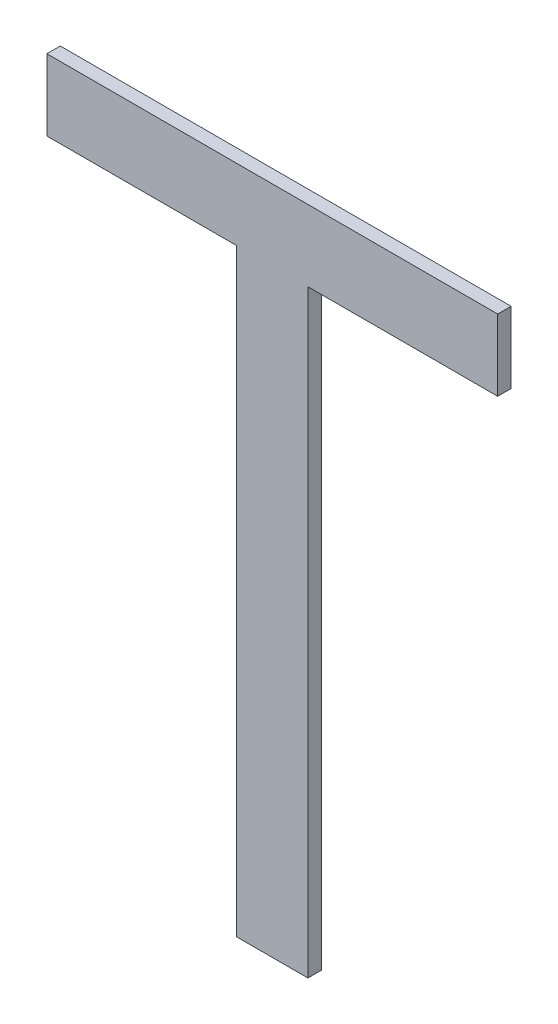
ISO-10303-21;
HEADER;
FILE_DESCRIPTION(('STEP AP214'),'2;1');
FILE_NAME('part.step','',(''),(''),'','','');
FILE_SCHEMA(('AUTOMOTIVE_DESIGN { 1 0 10303 214 1 1 1 1 }'));
ENDSEC;
DATA;
#1=APPLICATION_CONTEXT('core data for automotive mechanical design processes');
#2=APPLICATION_PROTOCOL_DEFINITION('international standard','automotive_design',2000,#1);
#3=PRODUCT_CONTEXT('',#1,'mechanical');
#4=PRODUCT('Part','Part','',(#3));
#5=PRODUCT_RELATED_PRODUCT_CATEGORY('part','',(#4));
#6=PRODUCT_DEFINITION_FORMATION('','',#4);
#7=PRODUCT_DEFINITION_CONTEXT('part definition',#1,'design');
#8=PRODUCT_DEFINITION('design','',#6,#7);
#9=PRODUCT_DEFINITION_SHAPE('','',#8);
#10=(LENGTH_UNIT() NAMED_UNIT(*) SI_UNIT(.MILLI.,.METRE.));
#11=(NAMED_UNIT(*) PLANE_ANGLE_UNIT() SI_UNIT($,.RADIAN.));
#12=(NAMED_UNIT(*) SI_UNIT($,.STERADIAN.) SOLID_ANGLE_UNIT());
#13=UNCERTAINTY_MEASURE_WITH_UNIT(LENGTH_MEASURE(1.E-05),#10,'distance_accuracy_value','');
#14=(GEOMETRIC_REPRESENTATION_CONTEXT(3) GLOBAL_UNCERTAINTY_ASSIGNED_CONTEXT((#13)) GLOBAL_UNIT_ASSIGNED_CONTEXT((#10,
#11,#12)) REPRESENTATION_CONTEXT('',''));
#15=CARTESIAN_POINT('',(0.,0.,0.));
#16=DIRECTION('',(0.,0.,1.));
#17=DIRECTION('',(1.,0.,0.));
#18=AXIS2_PLACEMENT_3D('',#15,#16,#17);
#19=CARTESIAN_POINT('',(161.371205904713,146.668671803981,5.9));
#20=DIRECTION('',(0.,0.,1.));
#21=DIRECTION('',(1.,0.,0.));
#22=AXIS2_PLACEMENT_3D('',#19,#20,#21);
#23=PLANE('',#22);
#24=DIRECTION('',(1.,0.,0.));
#25=VECTOR('',#24,1.);
#26=CARTESIAN_POINT('',(164.735789575803,147.200586634191,5.9));
#27=LINE('',#26,#25);
#28=CARTESIAN_POINT('',(161.371205904713,147.200586634191,5.9));
#29=VERTEX_POINT('',#28);
#30=CARTESIAN_POINT('',(164.735789575803,147.200586634191,5.9));
#31=VERTEX_POINT('',#30);
#32=EDGE_CURVE('E125',#29,#31,#27,.T.);
#33=ORIENTED_EDGE('',*,*,#32,.T.);
#34=DIRECTION('',(0.,1.,0.));
#35=VECTOR('',#34,1.);
#36=CARTESIAN_POINT('',(164.735789575803,146.668671803981,5.9));
#37=LINE('',#36,#35);
#38=CARTESIAN_POINT('',(164.735789575803,146.668671803981,5.9));
#39=VERTEX_POINT('',#38);
#40=EDGE_CURVE('E120',#31,#39,#37,.F.);
#41=ORIENTED_EDGE('',*,*,#40,.T.);
#42=DIRECTION('',(1.,0.,0.));
#43=VECTOR('',#42,1.);
#44=CARTESIAN_POINT('',(163.319123246893,146.668671803981,5.9));
#45=LINE('',#44,#43);
#46=CARTESIAN_POINT('',(163.319123246893,146.668671803981,5.9));
#47=VERTEX_POINT('',#46);
#48=EDGE_CURVE('E115',#39,#47,#45,.F.);
#49=ORIENTED_EDGE('',*,*,#48,.T.);
#50=DIRECTION('',(0.,1.,0.));
#51=VECTOR('',#50,1.);
#52=CARTESIAN_POINT('',(163.319123246893,142.200586634191,5.9));
#53=LINE('',#52,#51);
#54=CARTESIAN_POINT('',(163.319123246893,142.200586634191,5.9));
#55=VERTEX_POINT('',#54);
#56=EDGE_CURVE('E110',#47,#55,#53,.F.);
#57=ORIENTED_EDGE('',*,*,#56,.T.);
#58=DIRECTION('',(1.,0.,0.));
#59=VECTOR('',#58,1.);
#60=CARTESIAN_POINT('',(162.787873246893,142.200586634191,5.9));
#61=LINE('',#60,#59);
#62=CARTESIAN_POINT('',(162.787873246893,142.200586634191,5.9));
#63=VERTEX_POINT('',#62);
#64=EDGE_CURVE('E106',#55,#63,#61,.F.);
#65=ORIENTED_EDGE('',*,*,#64,.T.);
#66=DIRECTION('',(0.,1.,0.));
#67=VECTOR('',#66,1.);
#68=CARTESIAN_POINT('',(162.787873246893,146.668671803981,5.9));
#69=LINE('',#68,#67);
#70=CARTESIAN_POINT('',(162.787873246893,146.668671803981,5.9));
#71=VERTEX_POINT('',#70);
#72=EDGE_CURVE('E93',#63,#71,#69,.T.);
#73=ORIENTED_EDGE('',*,*,#72,.T.);
#74=DIRECTION('',(1.,0.,0.));
#75=VECTOR('',#74,1.);
#76=CARTESIAN_POINT('',(161.371205904713,146.668671803981,5.9));
#77=LINE('',#76,#75);
#78=CARTESIAN_POINT('',(161.371205904713,146.668671803981,5.9));
#79=VERTEX_POINT('',#78);
#80=EDGE_CURVE('E79',#71,#79,#77,.F.);
#81=ORIENTED_EDGE('',*,*,#80,.T.);
#82=DIRECTION('',(0.,1.,0.));
#83=VECTOR('',#82,1.);
#84=CARTESIAN_POINT('',(161.371205904713,147.200586634191,5.9));
#85=LINE('',#84,#83);
#86=EDGE_CURVE('E20',#79,#29,#85,.T.);
#87=ORIENTED_EDGE('',*,*,#86,.T.);
#88=EDGE_LOOP('',(#33,#41,#49,#57,#65,#73,#81,#87));
#89=FACE_BOUND('',#88,.T.);
#90=ADVANCED_FACE('F17',(#89),#23,.F.);
#91=CARTESIAN_POINT('',(161.371205904713,147.200586634191,6.));
#92=DIRECTION('',(1.,0.,0.));
#93=DIRECTION('',(0.,0.,-1.));
#94=AXIS2_PLACEMENT_3D('',#91,#92,#93);
#95=PLANE('',#94);
#96=DIRECTION('',(0.,0.,1.));
#97=VECTOR('',#96,1.);
#98=CARTESIAN_POINT('',(161.371205904713,146.668671803981,6.));
#99=LINE('',#98,#97);
#100=CARTESIAN_POINT('',(161.371205904713,146.668671803981,6.));
#101=VERTEX_POINT('',#100);
#102=EDGE_CURVE('E85',#79,#101,#99,.T.);
#103=ORIENTED_EDGE('',*,*,#102,.T.);
#104=DIRECTION('',(0.,1.,0.));
#105=VECTOR('',#104,1.);
#106=CARTESIAN_POINT('',(161.371205904713,146.668671803981,6.));
#107=LINE('',#106,#105);
#108=CARTESIAN_POINT('',(161.371205904713,147.200586634191,6.));
#109=VERTEX_POINT('',#108);
#110=EDGE_CURVE('E127',#109,#101,#107,.F.);
#111=ORIENTED_EDGE('',*,*,#110,.F.);
#112=DIRECTION('',(0.,0.,-1.));
#113=VECTOR('',#112,1.);
#114=CARTESIAN_POINT('',(161.371205904713,147.200586634191,6.));
#115=LINE('',#114,#113);
#116=EDGE_CURVE('E88',#109,#29,#115,.T.);
#117=ORIENTED_EDGE('',*,*,#116,.T.);
#118=ORIENTED_EDGE('',*,*,#86,.F.);
#119=EDGE_LOOP('',(#103,#111,#117,#118));
#120=FACE_BOUND('',#119,.T.);
#121=ADVANCED_FACE('F84',(#120),#95,.F.);
#122=CARTESIAN_POINT('',(161.371205904713,146.668671803981,6.));
#123=DIRECTION('',(0.,1.,0.));
#124=DIRECTION('',(0.,0.,1.));
#125=AXIS2_PLACEMENT_3D('',#122,#123,#124);
#126=PLANE('',#125);
#127=DIRECTION('',(0.,0.,-1.));
#128=VECTOR('',#127,1.);
#129=CARTESIAN_POINT('',(162.787873246893,146.668671803981,6.));
#130=LINE('',#129,#128);
#131=CARTESIAN_POINT('',(162.787873246893,146.668671803981,6.));
#132=VERTEX_POINT('',#131);
#133=EDGE_CURVE('E95',#71,#132,#130,.F.);
#134=ORIENTED_EDGE('',*,*,#133,.T.);
#135=DIRECTION('',(1.,0.,0.));
#136=VECTOR('',#135,1.);
#137=CARTESIAN_POINT('',(161.371205904713,146.668671803981,6.));
#138=LINE('',#137,#136);
#139=EDGE_CURVE('E99',#101,#132,#138,.T.);
#140=ORIENTED_EDGE('',*,*,#139,.F.);
#141=ORIENTED_EDGE('',*,*,#102,.F.);
#142=ORIENTED_EDGE('',*,*,#80,.F.);
#143=EDGE_LOOP('',(#134,#140,#141,#142));
#144=FACE_BOUND('',#143,.T.);
#145=ADVANCED_FACE('F97',(#144),#126,.F.);
#146=CARTESIAN_POINT('',(162.787873246893,146.668671803981,6.));
#147=DIRECTION('',(1.,0.,0.));
#148=DIRECTION('',(0.,0.,-1.));
#149=AXIS2_PLACEMENT_3D('',#146,#147,#148);
#150=PLANE('',#149);
#151=DIRECTION('',(0.,0.,1.));
#152=VECTOR('',#151,1.);
#153=CARTESIAN_POINT('',(162.787873246893,142.200586634191,6.));
#154=LINE('',#153,#152);
#155=CARTESIAN_POINT('',(162.787873246893,142.200586634191,6.));
#156=VERTEX_POINT('',#155);
#157=EDGE_CURVE('E104',#63,#156,#154,.T.);
#158=ORIENTED_EDGE('',*,*,#157,.T.);
#159=DIRECTION('',(0.,1.,0.));
#160=VECTOR('',#159,1.);
#161=CARTESIAN_POINT('',(162.787873246893,146.668671803981,6.));
#162=LINE('',#161,#160);
#163=EDGE_CURVE('E130',#132,#156,#162,.F.);
#164=ORIENTED_EDGE('',*,*,#163,.F.);
#165=ORIENTED_EDGE('',*,*,#133,.F.);
#166=ORIENTED_EDGE('',*,*,#72,.F.);
#167=EDGE_LOOP('',(#158,#164,#165,#166));
#168=FACE_BOUND('',#167,.T.);
#169=ADVANCED_FACE('F172',(#168),#150,.F.);
#170=CARTESIAN_POINT('',(162.787873246893,142.200586634191,6.));
#171=DIRECTION('',(0.,1.,0.));
#172=DIRECTION('',(0.,0.,1.));
#173=AXIS2_PLACEMENT_3D('',#170,#171,#172);
#174=PLANE('',#173);
#175=DIRECTION('',(0.,0.,1.));
#176=VECTOR('',#175,1.);
#177=CARTESIAN_POINT('',(163.319123246893,142.200586634191,6.));
#178=LINE('',#177,#176);
#179=CARTESIAN_POINT('',(163.319123246893,142.200586634191,6.));
#180=VERTEX_POINT('',#179);
#181=EDGE_CURVE('E108',#55,#180,#178,.T.);
#182=ORIENTED_EDGE('',*,*,#181,.T.);
#183=DIRECTION('',(1.,0.,0.));
#184=VECTOR('',#183,1.);
#185=CARTESIAN_POINT('',(161.371205904713,142.200586634191,6.));
#186=LINE('',#185,#184);
#187=EDGE_CURVE('E133',#156,#180,#186,.T.);
#188=ORIENTED_EDGE('',*,*,#187,.F.);
#189=ORIENTED_EDGE('',*,*,#157,.F.);
#190=ORIENTED_EDGE('',*,*,#64,.F.);
#191=EDGE_LOOP('',(#182,#188,#189,#190));
#192=FACE_BOUND('',#191,.T.);
#193=ADVANCED_FACE('F168',(#192),#174,.F.);
#194=CARTESIAN_POINT('',(163.319123246893,142.200586634191,6.));
#195=DIRECTION('',(-1.,0.,0.));
#196=DIRECTION('',(0.,0.,1.));
#197=AXIS2_PLACEMENT_3D('',#194,#195,#196);
#198=PLANE('',#197);
#199=DIRECTION('',(0.,0.,1.));
#200=VECTOR('',#199,1.);
#201=CARTESIAN_POINT('',(163.319123246893,146.668671803981,6.));
#202=LINE('',#201,#200);
#203=CARTESIAN_POINT('',(163.319123246893,146.668671803981,6.));
#204=VERTEX_POINT('',#203);
#205=EDGE_CURVE('E113',#47,#204,#202,.T.);
#206=ORIENTED_EDGE('',*,*,#205,.T.);
#207=DIRECTION('',(0.,1.,0.));
#208=VECTOR('',#207,1.);
#209=CARTESIAN_POINT('',(163.319123246893,146.668671803981,6.));
#210=LINE('',#209,#208);
#211=EDGE_CURVE('E136',#180,#204,#210,.T.);
#212=ORIENTED_EDGE('',*,*,#211,.F.);
#213=ORIENTED_EDGE('',*,*,#181,.F.);
#214=ORIENTED_EDGE('',*,*,#56,.F.);
#215=EDGE_LOOP('',(#206,#212,#213,#214));
#216=FACE_BOUND('',#215,.T.);
#217=ADVANCED_FACE('F165',(#216),#198,.F.);
#218=CARTESIAN_POINT('',(163.319123246893,146.668671803981,6.));
#219=DIRECTION('',(0.,1.,0.));
#220=DIRECTION('',(0.,0.,1.));
#221=AXIS2_PLACEMENT_3D('',#218,#219,#220);
#222=PLANE('',#221);
#223=DIRECTION('',(0.,0.,1.));
#224=VECTOR('',#223,1.);
#225=CARTESIAN_POINT('',(164.735789575803,146.668671803981,6.));
#226=LINE('',#225,#224);
#227=CARTESIAN_POINT('',(164.735789575803,146.668671803981,6.));
#228=VERTEX_POINT('',#227);
#229=EDGE_CURVE('E118',#39,#228,#226,.T.);
#230=ORIENTED_EDGE('',*,*,#229,.T.);
#231=DIRECTION('',(1.,0.,0.));
#232=VECTOR('',#231,1.);
#233=CARTESIAN_POINT('',(161.371205904713,146.668671803981,6.));
#234=LINE('',#233,#232);
#235=EDGE_CURVE('E139',#204,#228,#234,.T.);
#236=ORIENTED_EDGE('',*,*,#235,.F.);
#237=ORIENTED_EDGE('',*,*,#205,.F.);
#238=ORIENTED_EDGE('',*,*,#48,.F.);
#239=EDGE_LOOP('',(#230,#236,#237,#238));
#240=FACE_BOUND('',#239,.T.);
#241=ADVANCED_FACE('F149',(#240),#222,.F.);
#242=CARTESIAN_POINT('',(164.735789575803,146.668671803981,6.));
#243=DIRECTION('',(-1.,0.,0.));
#244=DIRECTION('',(0.,0.,1.));
#245=AXIS2_PLACEMENT_3D('',#242,#243,#244);
#246=PLANE('',#245);
#247=DIRECTION('',(0.,0.,-1.));
#248=VECTOR('',#247,1.);
#249=CARTESIAN_POINT('',(164.735789575803,147.200586634191,6.));
#250=LINE('',#249,#248);
#251=CARTESIAN_POINT('',(164.735789575803,147.200586634191,6.));
#252=VERTEX_POINT('',#251);
#253=EDGE_CURVE('E35',#31,#252,#250,.F.);
#254=ORIENTED_EDGE('',*,*,#253,.T.);
#255=DIRECTION('',(0.,1.,0.));
#256=VECTOR('',#255,1.);
#257=CARTESIAN_POINT('',(164.735789575803,146.668671803981,6.));
#258=LINE('',#257,#256);
#259=EDGE_CURVE('E26',#228,#252,#258,.T.);
#260=ORIENTED_EDGE('',*,*,#259,.F.);
#261=ORIENTED_EDGE('',*,*,#229,.F.);
#262=ORIENTED_EDGE('',*,*,#40,.F.);
#263=EDGE_LOOP('',(#254,#260,#261,#262));
#264=FACE_BOUND('',#263,.T.);
#265=ADVANCED_FACE('F147',(#264),#246,.F.);
#266=CARTESIAN_POINT('',(164.735789575803,147.200586634191,6.));
#267=DIRECTION('',(0.,-1.,0.));
#268=DIRECTION('',(0.,0.,-1.));
#269=AXIS2_PLACEMENT_3D('',#266,#267,#268);
#270=PLANE('',#269);
#271=ORIENTED_EDGE('',*,*,#116,.F.);
#272=DIRECTION('',(1.,0.,0.));
#273=VECTOR('',#272,1.);
#274=CARTESIAN_POINT('',(161.371205904713,147.200586634191,6.));
#275=LINE('',#274,#273);
#276=EDGE_CURVE('E11',#252,#109,#275,.F.);
#277=ORIENTED_EDGE('',*,*,#276,.F.);
#278=ORIENTED_EDGE('',*,*,#253,.F.);
#279=ORIENTED_EDGE('',*,*,#32,.F.);
#280=EDGE_LOOP('',(#271,#277,#278,#279));
#281=FACE_BOUND('',#280,.T.);
#282=ADVANCED_FACE('F152',(#281),#270,.F.);
#283=CARTESIAN_POINT('',(161.371205904713,146.668671803981,6.));
#284=DIRECTION('',(0.,0.,1.));
#285=DIRECTION('',(1.,0.,0.));
#286=AXIS2_PLACEMENT_3D('',#283,#284,#285);
#287=PLANE('',#286);
#288=ORIENTED_EDGE('',*,*,#259,.T.);
#289=ORIENTED_EDGE('',*,*,#276,.T.);
#290=ORIENTED_EDGE('',*,*,#110,.T.);
#291=ORIENTED_EDGE('',*,*,#139,.T.);
#292=ORIENTED_EDGE('',*,*,#163,.T.);
#293=ORIENTED_EDGE('',*,*,#187,.T.);
#294=ORIENTED_EDGE('',*,*,#211,.T.);
#295=ORIENTED_EDGE('',*,*,#235,.T.);
#296=EDGE_LOOP('',(#288,#289,#290,#291,#292,#293,#294,#295));
#297=FACE_BOUND('',#296,.T.);
#298=ADVANCED_FACE('F144',(#297),#287,.T.);
#299=CLOSED_SHELL('',(#90,#121,#145,#169,#193,#217,#241,#265,#282,#298));
#300=MANIFOLD_SOLID_BREP('B1',#299);
#301=ADVANCED_BREP_SHAPE_REPRESENTATION('',(#18,#300),#14);
#302=SHAPE_DEFINITION_REPRESENTATION(#9,#301);
ENDSEC;
END-ISO-10303-21;
